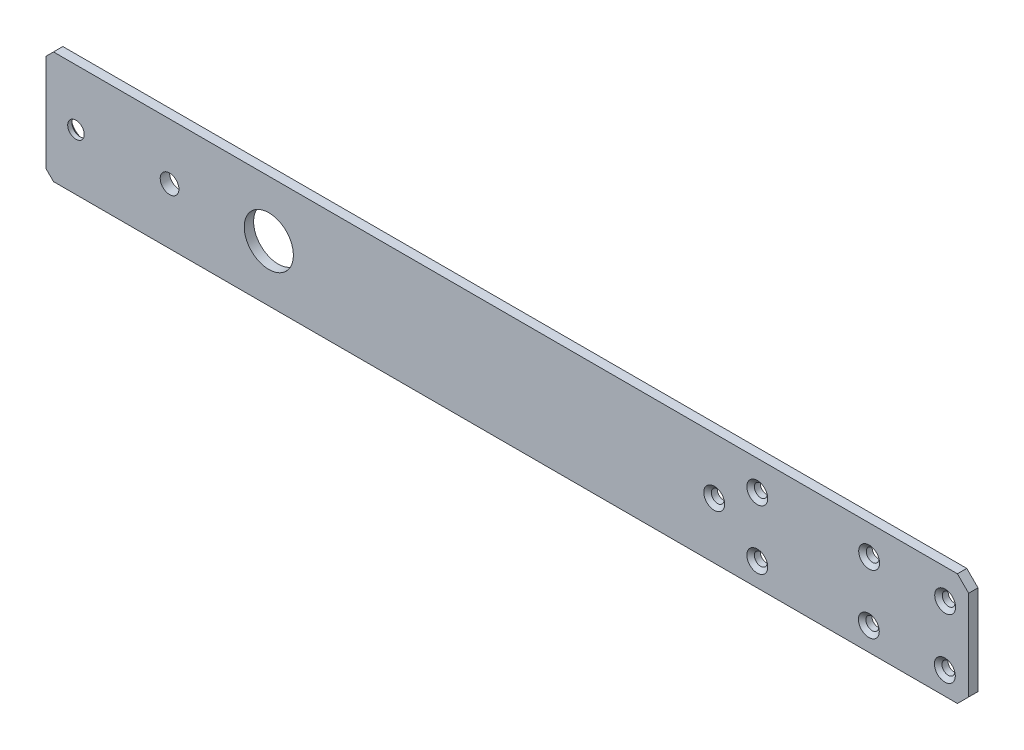
ISO-10303-21;
HEADER;
FILE_DESCRIPTION(('STEP AP214'),'2;1');
FILE_NAME('part.step','',(''),(''),'','','');
FILE_SCHEMA(('AUTOMOTIVE_DESIGN { 1 0 10303 214 1 1 1 1 }'));
ENDSEC;
DATA;
#1=APPLICATION_CONTEXT('core data for automotive mechanical design processes');
#2=APPLICATION_PROTOCOL_DEFINITION('international standard','automotive_design',2000,#1);
#3=PRODUCT_CONTEXT('',#1,'mechanical');
#4=PRODUCT('Part','Part','',(#3));
#5=PRODUCT_RELATED_PRODUCT_CATEGORY('part','',(#4));
#6=PRODUCT_DEFINITION_FORMATION('','',#4);
#7=PRODUCT_DEFINITION_CONTEXT('part definition',#1,'design');
#8=PRODUCT_DEFINITION('design','',#6,#7);
#9=PRODUCT_DEFINITION_SHAPE('','',#8);
#10=(LENGTH_UNIT() NAMED_UNIT(*) SI_UNIT(.MILLI.,.METRE.));
#11=(NAMED_UNIT(*) PLANE_ANGLE_UNIT() SI_UNIT($,.RADIAN.));
#12=(NAMED_UNIT(*) SI_UNIT($,.STERADIAN.) SOLID_ANGLE_UNIT());
#13=UNCERTAINTY_MEASURE_WITH_UNIT(LENGTH_MEASURE(1.E-05),#10,'distance_accuracy_value','');
#14=(GEOMETRIC_REPRESENTATION_CONTEXT(3) GLOBAL_UNCERTAINTY_ASSIGNED_CONTEXT((#13)) GLOBAL_UNIT_ASSIGNED_CONTEXT((#10,
#11,#12)) REPRESENTATION_CONTEXT('',''));
#15=CARTESIAN_POINT('',(0.,0.,0.));
#16=DIRECTION('',(0.,0.,1.));
#17=DIRECTION('',(1.,0.,0.));
#18=AXIS2_PLACEMENT_3D('',#15,#16,#17);
#19=CARTESIAN_POINT('',(0.,0.,1.5875));
#20=DIRECTION('',(0.,0.,-1.));
#21=DIRECTION('',(-1.,0.,0.));
#22=AXIS2_PLACEMENT_3D('',#19,#20,#21);
#23=PLANE('',#22);
#24=CARTESIAN_POINT('',(-33.6549999999997,0.,1.5875));
#25=DIRECTION('',(0.,0.,-1.));
#26=DIRECTION('',(-1.,0.,0.));
#27=AXIS2_PLACEMENT_3D('',#24,#25,#26);
#28=CIRCLE('',#27,3.175);
#29=CARTESIAN_POINT('',(-36.8299999999997,0.,1.5875));
#30=VERTEX_POINT('',#29);
#31=EDGE_CURVE('E495',#30,#30,#28,.T.);
#32=ORIENTED_EDGE('',*,*,#31,.T.);
#33=EDGE_LOOP('',(#32));
#34=FACE_BOUND('',#33,.T.);
#35=CARTESIAN_POINT('',(-65.4049999999997,0.,1.5875));
#36=DIRECTION('',(0.,0.,-1.));
#37=DIRECTION('',(-1.,0.,0.));
#38=AXIS2_PLACEMENT_3D('',#35,#36,#37);
#39=CIRCLE('',#38,2.8067);
#40=CARTESIAN_POINT('',(-68.2116999999997,0.,1.5875));
#41=VERTEX_POINT('',#40);
#42=EDGE_CURVE('E173',#41,#41,#39,.T.);
#43=ORIENTED_EDGE('',*,*,#42,.T.);
#44=EDGE_LOOP('',(#43));
#45=FACE_BOUND('',#44,.T.);
#46=CARTESIAN_POINT('',(203.608782335042,8.99137535087546,1.5875));
#47=DIRECTION('',(0.,0.,1.));
#48=DIRECTION('',(1.,0.,0.));
#49=AXIS2_PLACEMENT_3D('',#46,#47,#48);
#50=CIRCLE('',#49,3.5433);
#51=CARTESIAN_POINT('',(207.152082335042,8.99137535087546,1.5875));
#52=VERTEX_POINT('',#51);
#53=EDGE_CURVE('E175',#52,#52,#50,.T.);
#54=ORIENTED_EDGE('',*,*,#53,.F.);
#55=EDGE_LOOP('',(#54));
#56=FACE_BOUND('',#55,.T.);
#57=CARTESIAN_POINT('',(229.388701470581,8.92379178362501,1.5875));
#58=DIRECTION('',(0.,0.,1.));
#59=DIRECTION('',(1.,0.,0.));
#60=AXIS2_PLACEMENT_3D('',#57,#58,#59);
#61=CIRCLE('',#60,3.5433);
#62=CARTESIAN_POINT('',(232.932001470581,8.92379178362501,1.5875));
#63=VERTEX_POINT('',#62);
#64=EDGE_CURVE('E198',#63,#63,#61,.T.);
#65=ORIENTED_EDGE('',*,*,#64,.F.);
#66=EDGE_LOOP('',(#65));
#67=FACE_BOUND('',#66,.T.);
#68=CARTESIAN_POINT('',(165.672159691465,8.99137535087824,1.5875));
#69=DIRECTION('',(0.,0.,1.));
#70=DIRECTION('',(1.,0.,0.));
#71=AXIS2_PLACEMENT_3D('',#68,#69,#70);
#72=CIRCLE('',#71,3.5433);
#73=CARTESIAN_POINT('',(169.215459691465,8.99137535087824,1.5875));
#74=VERTEX_POINT('',#73);
#75=EDGE_CURVE('E204',#74,#74,#72,.T.);
#76=ORIENTED_EDGE('',*,*,#75,.F.);
#77=EDGE_LOOP('',(#76));
#78=FACE_BOUND('',#77,.T.);
#79=CARTESIAN_POINT('',(165.672159691465,-11.1439269688198,1.5875));
#80=DIRECTION('',(0.,0.,1.));
#81=DIRECTION('',(1.,0.,0.));
#82=AXIS2_PLACEMENT_3D('',#79,#80,#81);
#83=CIRCLE('',#82,3.5433);
#84=CARTESIAN_POINT('',(169.215459691465,-11.1439269688198,1.5875));
#85=VERTEX_POINT('',#84);
#86=EDGE_CURVE('E210',#85,#85,#83,.T.);
#87=ORIENTED_EDGE('',*,*,#86,.F.);
#88=EDGE_LOOP('',(#87));
#89=FACE_BOUND('',#88,.T.);
#90=CARTESIAN_POINT('',(151.067159691465,2.83106871279415E-12,1.5875));
#91=DIRECTION('',(0.,0.,1.));
#92=DIRECTION('',(1.,0.,0.));
#93=AXIS2_PLACEMENT_3D('',#90,#91,#92);
#94=CIRCLE('',#93,3.5433);
#95=CARTESIAN_POINT('',(154.610459691465,2.83106871279415E-12,1.5875));
#96=VERTEX_POINT('',#95);
#97=EDGE_CURVE('E216',#96,#96,#94,.T.);
#98=ORIENTED_EDGE('',*,*,#97,.F.);
#99=EDGE_LOOP('',(#98));
#100=FACE_BOUND('',#99,.T.);
#101=DIRECTION('',(-1.,0.,0.));
#102=VECTOR('',#101,1.);
#103=CARTESIAN_POINT('',(0.,19.05,1.5875));
#104=LINE('',#103,#102);
#105=CARTESIAN_POINT('',(233.542085197356,19.0500000000001,1.5875));
#106=VERTEX_POINT('',#105);
#107=CARTESIAN_POINT('',(-73.0249999999997,19.05,1.5875));
#108=VERTEX_POINT('',#107);
#109=EDGE_CURVE('E121',#106,#108,#104,.T.);
#110=ORIENTED_EDGE('',*,*,#109,.T.);
#111=DIRECTION('',(-0.70710678118654,-0.707106781186555,0.));
#112=VECTOR('',#111,1.);
#113=CARTESIAN_POINT('',(-73.0249999999997,19.05,1.5875));
#114=LINE('',#113,#112);
#115=CARTESIAN_POINT('',(-75.5649999999997,16.5099999999999,1.5875));
#116=VERTEX_POINT('',#115);
#117=EDGE_CURVE('E144',#108,#116,#114,.T.);
#118=ORIENTED_EDGE('',*,*,#117,.T.);
#119=DIRECTION('',(0.,-1.,0.));
#120=VECTOR('',#119,1.);
#121=CARTESIAN_POINT('',(-75.5649999999997,19.05,1.5875));
#122=LINE('',#121,#120);
#123=CARTESIAN_POINT('',(-75.5649999999997,-16.51,1.5875));
#124=VERTEX_POINT('',#123);
#125=EDGE_CURVE('E169',#116,#124,#122,.T.);
#126=ORIENTED_EDGE('',*,*,#125,.T.);
#127=DIRECTION('',(0.707106781186551,-0.707106781186544,0.));
#128=VECTOR('',#127,1.);
#129=CARTESIAN_POINT('',(-75.5649999999997,-16.51,1.5875));
#130=LINE('',#129,#128);
#131=CARTESIAN_POINT('',(-73.0249999999996,-19.05,1.5875));
#132=VERTEX_POINT('',#131);
#133=EDGE_CURVE('E142',#124,#132,#130,.T.);
#134=ORIENTED_EDGE('',*,*,#133,.T.);
#135=DIRECTION('',(1.,0.,0.));
#136=VECTOR('',#135,1.);
#137=CARTESIAN_POINT('',(-28.5749999999997,-19.05,1.5875));
#138=LINE('',#137,#136);
#139=CARTESIAN_POINT('',(233.542085197356,-19.05,1.5875));
#140=VERTEX_POINT('',#139);
#141=EDGE_CURVE('E124',#132,#140,#138,.T.);
#142=ORIENTED_EDGE('',*,*,#141,.T.);
#143=DIRECTION('',(-0.707106781186548,-0.707106781186547,0.));
#144=VECTOR('',#143,1.);
#145=CARTESIAN_POINT('',(233.542085197356,-19.05,1.5875));
#146=LINE('',#145,#144);
#147=CARTESIAN_POINT('',(237.352085197356,-15.24,1.5875));
#148=VERTEX_POINT('',#147);
#149=EDGE_CURVE('E120',#140,#148,#146,.F.);
#150=ORIENTED_EDGE('',*,*,#149,.T.);
#151=DIRECTION('',(0.,-1.,0.));
#152=VECTOR('',#151,1.);
#153=CARTESIAN_POINT('',(237.352085197356,19.0500000000001,1.5875));
#154=LINE('',#153,#152);
#155=CARTESIAN_POINT('',(237.352085197356,15.24,1.5875));
#156=VERTEX_POINT('',#155);
#157=EDGE_CURVE('E222',#156,#148,#154,.T.);
#158=ORIENTED_EDGE('',*,*,#157,.F.);
#159=DIRECTION('',(0.707106781186547,-0.707106781186548,0.));
#160=VECTOR('',#159,1.);
#161=CARTESIAN_POINT('',(237.352085197356,15.24,1.5875));
#162=LINE('',#161,#160);
#163=EDGE_CURVE('E130',#156,#106,#162,.F.);
#164=ORIENTED_EDGE('',*,*,#163,.T.);
#165=EDGE_LOOP('',(#110,#118,#126,#134,#142,#150,#158,#164));
#166=FACE_BOUND('',#165,.T.);
#167=CARTESIAN_POINT('',(0.,0.,1.5875));
#168=DIRECTION('',(0.,0.,1.));
#169=DIRECTION('',(1.,0.,0.));
#170=AXIS2_PLACEMENT_3D('',#167,#168,#169);
#171=CIRCLE('',#170,8.334375);
#172=CARTESIAN_POINT('',(8.334375,0.,1.5875));
#173=VERTEX_POINT('',#172);
#174=EDGE_CURVE('E105',#173,#173,#171,.T.);
#175=ORIENTED_EDGE('',*,*,#174,.F.);
#176=EDGE_LOOP('',(#175));
#177=FACE_BOUND('',#176,.T.);
#178=CARTESIAN_POINT('',(229.282371238552,-11.3467989682312,1.5875));
#179=DIRECTION('',(0.,0.,1.));
#180=DIRECTION('',(1.,0.,0.));
#181=AXIS2_PLACEMENT_3D('',#178,#179,#180);
#182=CIRCLE('',#181,3.5433);
#183=CARTESIAN_POINT('',(232.825671238552,-11.3467989682312,1.5875));
#184=VERTEX_POINT('',#183);
#185=EDGE_CURVE('E192',#184,#184,#182,.T.);
#186=ORIENTED_EDGE('',*,*,#185,.F.);
#187=EDGE_LOOP('',(#186));
#188=FACE_BOUND('',#187,.T.);
#189=CARTESIAN_POINT('',(203.503161764145,-11.1439269688226,1.5875));
#190=DIRECTION('',(0.,0.,1.));
#191=DIRECTION('',(1.,0.,0.));
#192=AXIS2_PLACEMENT_3D('',#189,#190,#191);
#193=CIRCLE('',#192,3.5433);
#194=CARTESIAN_POINT('',(207.046461764145,-11.1439269688226,1.5875));
#195=VERTEX_POINT('',#194);
#196=EDGE_CURVE('E186',#195,#195,#193,.T.);
#197=ORIENTED_EDGE('',*,*,#196,.F.);
#198=EDGE_LOOP('',(#197));
#199=FACE_BOUND('',#198,.T.);
#200=ADVANCED_FACE('F36',(#34,#45,#56,#67,#78,#89,#100,#166,#177,#188,#199),#23,.F.);
#201=CARTESIAN_POINT('',(0.,0.,-1.5875));
#202=DIRECTION('',(0.,0.,-1.));
#203=DIRECTION('',(-1.,0.,0.));
#204=AXIS2_PLACEMENT_3D('',#201,#202,#203);
#205=PLANE('',#204);
#206=CARTESIAN_POINT('',(-33.6549999999997,0.,-1.5875));
#207=DIRECTION('',(0.,0.,-1.));
#208=DIRECTION('',(-1.,0.,0.));
#209=AXIS2_PLACEMENT_3D('',#206,#207,#208);
#210=CIRCLE('',#209,3.175);
#211=CARTESIAN_POINT('',(-36.8299999999997,0.,-1.5875));
#212=VERTEX_POINT('',#211);
#213=EDGE_CURVE('E498',#212,#212,#210,.T.);
#214=ORIENTED_EDGE('',*,*,#213,.F.);
#215=EDGE_LOOP('',(#214));
#216=FACE_BOUND('',#215,.T.);
#217=CARTESIAN_POINT('',(-65.4049999999997,0.,-1.5875));
#218=DIRECTION('',(0.,0.,-1.));
#219=DIRECTION('',(-1.,0.,0.));
#220=AXIS2_PLACEMENT_3D('',#217,#218,#219);
#221=CIRCLE('',#220,4.8895);
#222=CARTESIAN_POINT('',(-70.2944999999996,0.,-1.5875));
#223=VERTEX_POINT('',#222);
#224=EDGE_CURVE('E500',#223,#223,#221,.T.);
#225=ORIENTED_EDGE('',*,*,#224,.F.);
#226=EDGE_LOOP('',(#225));
#227=FACE_BOUND('',#226,.T.);
#228=DIRECTION('',(0.,-1.,0.));
#229=VECTOR('',#228,1.);
#230=CARTESIAN_POINT('',(-75.5649999999997,19.05,-1.5875));
#231=LINE('',#230,#229);
#232=CARTESIAN_POINT('',(-75.5649999999997,16.5099999999999,-1.5875));
#233=VERTEX_POINT('',#232);
#234=CARTESIAN_POINT('',(-75.5649999999997,-16.51,-1.5875));
#235=VERTEX_POINT('',#234);
#236=EDGE_CURVE('E155',#233,#235,#231,.T.);
#237=ORIENTED_EDGE('',*,*,#236,.F.);
#238=DIRECTION('',(0.70710678118654,0.707106781186555,0.));
#239=VECTOR('',#238,1.);
#240=CARTESIAN_POINT('',(-46.0375000000006,46.0374999999996,-1.5875));
#241=LINE('',#240,#239);
#242=CARTESIAN_POINT('',(-73.0249999999996,19.05,-1.5875));
#243=VERTEX_POINT('',#242);
#244=EDGE_CURVE('E44',#233,#243,#241,.T.);
#245=ORIENTED_EDGE('',*,*,#244,.T.);
#246=DIRECTION('',(-1.,0.,0.));
#247=VECTOR('',#246,1.);
#248=CARTESIAN_POINT('',(0.,19.05,-1.5875));
#249=LINE('',#248,#247);
#250=CARTESIAN_POINT('',(233.542085197356,19.0500000000001,-1.5875));
#251=VERTEX_POINT('',#250);
#252=EDGE_CURVE('E104',#251,#243,#249,.T.);
#253=ORIENTED_EDGE('',*,*,#252,.F.);
#254=DIRECTION('',(-0.707106781186547,0.707106781186548,0.));
#255=VECTOR('',#254,1.);
#256=CARTESIAN_POINT('',(126.296042598678,126.296042598678,-1.5875));
#257=LINE('',#256,#255);
#258=CARTESIAN_POINT('',(237.352085197356,15.24,-1.5875));
#259=VERTEX_POINT('',#258);
#260=EDGE_CURVE('E116',#251,#259,#257,.F.);
#261=ORIENTED_EDGE('',*,*,#260,.T.);
#262=DIRECTION('',(0.,-1.,0.));
#263=VECTOR('',#262,1.);
#264=CARTESIAN_POINT('',(237.352085197356,19.0500000000001,-1.5875));
#265=LINE('',#264,#263);
#266=CARTESIAN_POINT('',(237.352085197356,-15.24,-1.5875));
#267=VERTEX_POINT('',#266);
#268=EDGE_CURVE('E113',#259,#267,#265,.T.);
#269=ORIENTED_EDGE('',*,*,#268,.T.);
#270=DIRECTION('',(0.707106781186548,0.707106781186547,0.));
#271=VECTOR('',#270,1.);
#272=CARTESIAN_POINT('',(126.296042598678,-126.296042598678,-1.5875));
#273=LINE('',#272,#271);
#274=CARTESIAN_POINT('',(233.542085197356,-19.05,-1.5875));
#275=VERTEX_POINT('',#274);
#276=EDGE_CURVE('E109',#267,#275,#273,.F.);
#277=ORIENTED_EDGE('',*,*,#276,.T.);
#278=DIRECTION('',(1.,0.,0.));
#279=VECTOR('',#278,1.);
#280=CARTESIAN_POINT('',(0.,-19.05,-1.5875));
#281=LINE('',#280,#279);
#282=CARTESIAN_POINT('',(-73.0249999999997,-19.05,-1.5875));
#283=VERTEX_POINT('',#282);
#284=EDGE_CURVE('E99',#283,#275,#281,.T.);
#285=ORIENTED_EDGE('',*,*,#284,.F.);
#286=DIRECTION('',(-0.707106781186551,0.707106781186544,0.));
#287=VECTOR('',#286,1.);
#288=CARTESIAN_POINT('',(-46.0374999999995,-46.0374999999999,-1.5875));
#289=LINE('',#288,#287);
#290=EDGE_CURVE('E56',#283,#235,#289,.T.);
#291=ORIENTED_EDGE('',*,*,#290,.T.);
#292=EDGE_LOOP('',(#237,#245,#253,#261,#269,#277,#285,#291));
#293=FACE_BOUND('',#292,.T.);
#294=CARTESIAN_POINT('',(229.388701470581,8.92379178362501,-1.5875));
#295=DIRECTION('',(0.,0.,1.));
#296=DIRECTION('',(1.,0.,0.));
#297=AXIS2_PLACEMENT_3D('',#294,#295,#296);
#298=CIRCLE('',#297,2.15265000000001);
#299=CARTESIAN_POINT('',(231.541351470581,8.92379178362501,-1.5875));
#300=VERTEX_POINT('',#299);
#301=EDGE_CURVE('E224',#300,#300,#298,.T.);
#302=ORIENTED_EDGE('',*,*,#301,.T.);
#303=EDGE_LOOP('',(#302));
#304=FACE_BOUND('',#303,.T.);
#305=CARTESIAN_POINT('',(229.282371238552,-11.3467989682312,-1.5875));
#306=DIRECTION('',(0.,0.,1.));
#307=DIRECTION('',(1.,0.,0.));
#308=AXIS2_PLACEMENT_3D('',#305,#306,#307);
#309=CIRCLE('',#308,2.15265000000001);
#310=CARTESIAN_POINT('',(231.435021238552,-11.3467989682312,-1.5875));
#311=VERTEX_POINT('',#310);
#312=EDGE_CURVE('E229',#311,#311,#309,.T.);
#313=ORIENTED_EDGE('',*,*,#312,.T.);
#314=EDGE_LOOP('',(#313));
#315=FACE_BOUND('',#314,.T.);
#316=CARTESIAN_POINT('',(203.503161764145,-11.1439269688226,-1.5875));
#317=DIRECTION('',(0.,0.,1.));
#318=DIRECTION('',(1.,0.,0.));
#319=AXIS2_PLACEMENT_3D('',#316,#317,#318);
#320=CIRCLE('',#319,2.15265000000001);
#321=CARTESIAN_POINT('',(205.655811764145,-11.1439269688226,-1.5875));
#322=VERTEX_POINT('',#321);
#323=EDGE_CURVE('E232',#322,#322,#320,.T.);
#324=ORIENTED_EDGE('',*,*,#323,.T.);
#325=EDGE_LOOP('',(#324));
#326=FACE_BOUND('',#325,.T.);
#327=CARTESIAN_POINT('',(203.608782335042,8.99137535087546,-1.5875));
#328=DIRECTION('',(0.,0.,1.));
#329=DIRECTION('',(1.,0.,0.));
#330=AXIS2_PLACEMENT_3D('',#327,#328,#329);
#331=CIRCLE('',#330,2.15265000000001);
#332=CARTESIAN_POINT('',(205.761432335042,8.99137535087546,-1.5875));
#333=VERTEX_POINT('',#332);
#334=EDGE_CURVE('E235',#333,#333,#331,.T.);
#335=ORIENTED_EDGE('',*,*,#334,.T.);
#336=EDGE_LOOP('',(#335));
#337=FACE_BOUND('',#336,.T.);
#338=CARTESIAN_POINT('',(165.672159691465,8.99137535087824,-1.5875));
#339=DIRECTION('',(0.,0.,1.));
#340=DIRECTION('',(1.,0.,0.));
#341=AXIS2_PLACEMENT_3D('',#338,#339,#340);
#342=CIRCLE('',#341,2.15265000000001);
#343=CARTESIAN_POINT('',(167.824809691465,8.99137535087824,-1.5875));
#344=VERTEX_POINT('',#343);
#345=EDGE_CURVE('E238',#344,#344,#342,.T.);
#346=ORIENTED_EDGE('',*,*,#345,.T.);
#347=EDGE_LOOP('',(#346));
#348=FACE_BOUND('',#347,.T.);
#349=CARTESIAN_POINT('',(165.672159691465,-11.1439269688198,-1.5875));
#350=DIRECTION('',(0.,0.,1.));
#351=DIRECTION('',(1.,0.,0.));
#352=AXIS2_PLACEMENT_3D('',#349,#350,#351);
#353=CIRCLE('',#352,2.15265000000001);
#354=CARTESIAN_POINT('',(167.824809691465,-11.1439269688198,-1.5875));
#355=VERTEX_POINT('',#354);
#356=EDGE_CURVE('E241',#355,#355,#353,.T.);
#357=ORIENTED_EDGE('',*,*,#356,.T.);
#358=EDGE_LOOP('',(#357));
#359=FACE_BOUND('',#358,.T.);
#360=CARTESIAN_POINT('',(151.067159691465,2.83106871279415E-12,-1.5875));
#361=DIRECTION('',(0.,0.,1.));
#362=DIRECTION('',(1.,0.,0.));
#363=AXIS2_PLACEMENT_3D('',#360,#361,#362);
#364=CIRCLE('',#363,2.15265000000001);
#365=CARTESIAN_POINT('',(153.219809691465,2.83106871279415E-12,-1.5875));
#366=VERTEX_POINT('',#365);
#367=EDGE_CURVE('E244',#366,#366,#364,.T.);
#368=ORIENTED_EDGE('',*,*,#367,.T.);
#369=EDGE_LOOP('',(#368));
#370=FACE_BOUND('',#369,.T.);
#371=CARTESIAN_POINT('',(0.,0.,-1.5875));
#372=DIRECTION('',(0.,0.,1.));
#373=DIRECTION('',(1.,0.,0.));
#374=AXIS2_PLACEMENT_3D('',#371,#372,#373);
#375=CIRCLE('',#374,8.334375);
#376=CARTESIAN_POINT('',(8.334375,0.,-1.5875));
#377=VERTEX_POINT('',#376);
#378=EDGE_CURVE('E247',#377,#377,#375,.T.);
#379=ORIENTED_EDGE('',*,*,#378,.T.);
#380=EDGE_LOOP('',(#379));
#381=FACE_BOUND('',#380,.T.);
#382=ADVANCED_FACE('F110',(#216,#227,#293,#304,#315,#326,#337,#348,#359,#370,#381),#205,.T.);
#383=CARTESIAN_POINT('',(0.,-19.05,1.5875));
#384=DIRECTION('',(0.,1.,0.));
#385=DIRECTION('',(0.,0.,1.));
#386=AXIS2_PLACEMENT_3D('',#383,#384,#385);
#387=PLANE('',#386);
#388=ORIENTED_EDGE('',*,*,#141,.F.);
#389=DIRECTION('',(0.,0.,-1.));
#390=VECTOR('',#389,1.);
#391=CARTESIAN_POINT('',(-73.0249999999997,-19.05,-1.5875));
#392=LINE('',#391,#390);
#393=EDGE_CURVE('E11',#132,#283,#392,.T.);
#394=ORIENTED_EDGE('',*,*,#393,.T.);
#395=ORIENTED_EDGE('',*,*,#284,.T.);
#396=DIRECTION('',(0.,0.,1.));
#397=VECTOR('',#396,1.);
#398=CARTESIAN_POINT('',(233.542085197356,-19.05,1.5875));
#399=LINE('',#398,#397);
#400=EDGE_CURVE('E103',#275,#140,#399,.T.);
#401=ORIENTED_EDGE('',*,*,#400,.T.);
#402=EDGE_LOOP('',(#388,#394,#395,#401));
#403=FACE_BOUND('',#402,.T.);
#404=ADVANCED_FACE('F101',(#403),#387,.F.);
#405=CARTESIAN_POINT('',(0.,19.05,1.5875));
#406=DIRECTION('',(0.,-1.,0.));
#407=DIRECTION('',(1.,0.,0.));
#408=AXIS2_PLACEMENT_3D('',#405,#406,#407);
#409=PLANE('',#408);
#410=ORIENTED_EDGE('',*,*,#252,.T.);
#411=DIRECTION('',(0.,0.,1.));
#412=VECTOR('',#411,1.);
#413=CARTESIAN_POINT('',(-73.0249999999997,19.05,1.5875));
#414=LINE('',#413,#412);
#415=EDGE_CURVE('E139',#243,#108,#414,.T.);
#416=ORIENTED_EDGE('',*,*,#415,.T.);
#417=ORIENTED_EDGE('',*,*,#109,.F.);
#418=DIRECTION('',(0.,0.,-1.));
#419=VECTOR('',#418,1.);
#420=CARTESIAN_POINT('',(233.542085197356,19.0500000000001,1.5875));
#421=LINE('',#420,#419);
#422=EDGE_CURVE('E132',#106,#251,#421,.T.);
#423=ORIENTED_EDGE('',*,*,#422,.T.);
#424=EDGE_LOOP('',(#410,#416,#417,#423));
#425=FACE_BOUND('',#424,.T.);
#426=ADVANCED_FACE('F160',(#425),#409,.F.);
#427=CARTESIAN_POINT('',(0.,0.,1.5875));
#428=DIRECTION('',(0.,0.,-1.));
#429=DIRECTION('',(-1.,0.,0.));
#430=AXIS2_PLACEMENT_3D('',#427,#428,#429);
#431=CYLINDRICAL_SURFACE('',#430,8.334375);
#432=ORIENTED_EDGE('',*,*,#174,.T.);
#433=EDGE_LOOP('',(#432));
#434=FACE_BOUND('',#433,.T.);
#435=ORIENTED_EDGE('',*,*,#378,.F.);
#436=EDGE_LOOP('',(#435));
#437=FACE_BOUND('',#436,.T.);
#438=ADVANCED_FACE('F274',(#434,#437),#431,.F.);
#439=CARTESIAN_POINT('',(151.067159691465,2.83106871279415E-12,1.5875));
#440=DIRECTION('',(0.,0.,1.));
#441=DIRECTION('',(1.,0.,0.));
#442=AXIS2_PLACEMENT_3D('',#439,#440,#441);
#443=CYLINDRICAL_SURFACE('',#442,2.15265000000001);
#444=CARTESIAN_POINT('',(151.067159691465,2.83106871279415E-12,0.420606097903323));
#445=DIRECTION('',(0.,0.,1.));
#446=DIRECTION('',(1.,0.,0.));
#447=AXIS2_PLACEMENT_3D('',#444,#445,#446);
#448=CIRCLE('',#447,2.15264999999998);
#449=CARTESIAN_POINT('',(153.219809691465,2.83106871279415E-12,0.420606097903323));
#450=VERTEX_POINT('',#449);
#451=EDGE_CURVE('E219',#450,#450,#448,.T.);
#452=ORIENTED_EDGE('',*,*,#451,.T.);
#453=EDGE_LOOP('',(#452));
#454=FACE_BOUND('',#453,.T.);
#455=ORIENTED_EDGE('',*,*,#367,.F.);
#456=EDGE_LOOP('',(#455));
#457=FACE_BOUND('',#456,.T.);
#458=ADVANCED_FACE('F329',(#454,#457),#443,.F.);
#459=CARTESIAN_POINT('',(165.672159691465,-11.1439269688198,1.5875));
#460=DIRECTION('',(0.,0.,1.));
#461=DIRECTION('',(1.,0.,0.));
#462=AXIS2_PLACEMENT_3D('',#459,#460,#461);
#463=CYLINDRICAL_SURFACE('',#462,2.15265000000001);
#464=CARTESIAN_POINT('',(165.672159691465,-11.1439269688198,0.420606097903323));
#465=DIRECTION('',(0.,0.,1.));
#466=DIRECTION('',(1.,0.,0.));
#467=AXIS2_PLACEMENT_3D('',#464,#465,#466);
#468=CIRCLE('',#467,2.15264999999998);
#469=CARTESIAN_POINT('',(167.824809691465,-11.1439269688198,0.420606097903323));
#470=VERTEX_POINT('',#469);
#471=EDGE_CURVE('E213',#470,#470,#468,.T.);
#472=ORIENTED_EDGE('',*,*,#471,.T.);
#473=EDGE_LOOP('',(#472));
#474=FACE_BOUND('',#473,.T.);
#475=ORIENTED_EDGE('',*,*,#356,.F.);
#476=EDGE_LOOP('',(#475));
#477=FACE_BOUND('',#476,.T.);
#478=ADVANCED_FACE('F326',(#474,#477),#463,.F.);
#479=CARTESIAN_POINT('',(165.672159691465,8.99137535087824,1.5875));
#480=DIRECTION('',(0.,0.,1.));
#481=DIRECTION('',(1.,0.,0.));
#482=AXIS2_PLACEMENT_3D('',#479,#480,#481);
#483=CYLINDRICAL_SURFACE('',#482,2.15265000000001);
#484=CARTESIAN_POINT('',(165.672159691465,8.99137535087824,0.420606097903323));
#485=DIRECTION('',(0.,0.,1.));
#486=DIRECTION('',(1.,0.,0.));
#487=AXIS2_PLACEMENT_3D('',#484,#485,#486);
#488=CIRCLE('',#487,2.15264999999998);
#489=CARTESIAN_POINT('',(167.824809691465,8.99137535087824,0.420606097903323));
#490=VERTEX_POINT('',#489);
#491=EDGE_CURVE('E207',#490,#490,#488,.T.);
#492=ORIENTED_EDGE('',*,*,#491,.T.);
#493=EDGE_LOOP('',(#492));
#494=FACE_BOUND('',#493,.T.);
#495=ORIENTED_EDGE('',*,*,#345,.F.);
#496=EDGE_LOOP('',(#495));
#497=FACE_BOUND('',#496,.T.);
#498=ADVANCED_FACE('F322',(#494,#497),#483,.F.);
#499=CARTESIAN_POINT('',(203.608782335042,8.99137535087546,1.5875));
#500=DIRECTION('',(0.,0.,1.));
#501=DIRECTION('',(1.,0.,0.));
#502=AXIS2_PLACEMENT_3D('',#499,#500,#501);
#503=CYLINDRICAL_SURFACE('',#502,2.15265000000001);
#504=CARTESIAN_POINT('',(203.608782335042,8.99137535087546,0.420606097903323));
#505=DIRECTION('',(0.,0.,1.));
#506=DIRECTION('',(1.,0.,0.));
#507=AXIS2_PLACEMENT_3D('',#504,#505,#506);
#508=CIRCLE('',#507,2.15264999999998);
#509=CARTESIAN_POINT('',(205.761432335042,8.99137535087546,0.420606097903323));
#510=VERTEX_POINT('',#509);
#511=EDGE_CURVE('E183',#510,#510,#508,.T.);
#512=ORIENTED_EDGE('',*,*,#511,.T.);
#513=EDGE_LOOP('',(#512));
#514=FACE_BOUND('',#513,.T.);
#515=ORIENTED_EDGE('',*,*,#334,.F.);
#516=EDGE_LOOP('',(#515));
#517=FACE_BOUND('',#516,.T.);
#518=ADVANCED_FACE('F318',(#514,#517),#503,.F.);
#519=CARTESIAN_POINT('',(203.503161764145,-11.1439269688226,1.5875));
#520=DIRECTION('',(0.,0.,1.));
#521=DIRECTION('',(1.,0.,0.));
#522=AXIS2_PLACEMENT_3D('',#519,#520,#521);
#523=CYLINDRICAL_SURFACE('',#522,2.15265000000001);
#524=CARTESIAN_POINT('',(203.503161764145,-11.1439269688226,0.420606097903323));
#525=DIRECTION('',(0.,0.,1.));
#526=DIRECTION('',(1.,0.,0.));
#527=AXIS2_PLACEMENT_3D('',#524,#525,#526);
#528=CIRCLE('',#527,2.15264999999998);
#529=CARTESIAN_POINT('',(205.655811764145,-11.1439269688226,0.420606097903323));
#530=VERTEX_POINT('',#529);
#531=EDGE_CURVE('E189',#530,#530,#528,.T.);
#532=ORIENTED_EDGE('',*,*,#531,.T.);
#533=EDGE_LOOP('',(#532));
#534=FACE_BOUND('',#533,.T.);
#535=ORIENTED_EDGE('',*,*,#323,.F.);
#536=EDGE_LOOP('',(#535));
#537=FACE_BOUND('',#536,.T.);
#538=ADVANCED_FACE('F314',(#534,#537),#523,.F.);
#539=CARTESIAN_POINT('',(229.282371238552,-11.3467989682312,1.5875));
#540=DIRECTION('',(0.,0.,1.));
#541=DIRECTION('',(1.,0.,0.));
#542=AXIS2_PLACEMENT_3D('',#539,#540,#541);
#543=CYLINDRICAL_SURFACE('',#542,2.15265000000001);
#544=CARTESIAN_POINT('',(229.282371238552,-11.3467989682312,0.420606097903323));
#545=DIRECTION('',(0.,0.,1.));
#546=DIRECTION('',(1.,0.,0.));
#547=AXIS2_PLACEMENT_3D('',#544,#545,#546);
#548=CIRCLE('',#547,2.15264999999998);
#549=CARTESIAN_POINT('',(231.435021238552,-11.3467989682312,0.420606097903323));
#550=VERTEX_POINT('',#549);
#551=EDGE_CURVE('E195',#550,#550,#548,.T.);
#552=ORIENTED_EDGE('',*,*,#551,.T.);
#553=EDGE_LOOP('',(#552));
#554=FACE_BOUND('',#553,.T.);
#555=ORIENTED_EDGE('',*,*,#312,.F.);
#556=EDGE_LOOP('',(#555));
#557=FACE_BOUND('',#556,.T.);
#558=ADVANCED_FACE('F310',(#554,#557),#543,.F.);
#559=CARTESIAN_POINT('',(229.388701470581,8.92379178362501,1.5875));
#560=DIRECTION('',(0.,0.,1.));
#561=DIRECTION('',(1.,0.,0.));
#562=AXIS2_PLACEMENT_3D('',#559,#560,#561);
#563=CYLINDRICAL_SURFACE('',#562,2.15265000000001);
#564=CARTESIAN_POINT('',(229.388701470581,8.92379178362501,0.420606097903323));
#565=DIRECTION('',(0.,0.,1.));
#566=DIRECTION('',(1.,0.,0.));
#567=AXIS2_PLACEMENT_3D('',#564,#565,#566);
#568=CIRCLE('',#567,2.15264999999998);
#569=CARTESIAN_POINT('',(231.541351470581,8.92379178362501,0.420606097903323));
#570=VERTEX_POINT('',#569);
#571=EDGE_CURVE('E201',#570,#570,#568,.T.);
#572=ORIENTED_EDGE('',*,*,#571,.T.);
#573=EDGE_LOOP('',(#572));
#574=FACE_BOUND('',#573,.T.);
#575=ORIENTED_EDGE('',*,*,#301,.F.);
#576=EDGE_LOOP('',(#575));
#577=FACE_BOUND('',#576,.T.);
#578=ADVANCED_FACE('F306',(#574,#577),#563,.F.);
#579=CARTESIAN_POINT('',(237.352085197356,19.0500000000001,-1.5875));
#580=DIRECTION('',(-1.,0.,0.));
#581=DIRECTION('',(0.,-1.,0.));
#582=AXIS2_PLACEMENT_3D('',#579,#580,#581);
#583=PLANE('',#582);
#584=ORIENTED_EDGE('',*,*,#268,.F.);
#585=DIRECTION('',(0.,0.,1.));
#586=VECTOR('',#585,1.);
#587=CARTESIAN_POINT('',(237.352085197356,15.24,-1.5875));
#588=LINE('',#587,#586);
#589=EDGE_CURVE('E136',#259,#156,#588,.T.);
#590=ORIENTED_EDGE('',*,*,#589,.T.);
#591=ORIENTED_EDGE('',*,*,#157,.T.);
#592=DIRECTION('',(0.,0.,-1.));
#593=VECTOR('',#592,1.);
#594=CARTESIAN_POINT('',(237.352085197356,-15.24,-1.5875));
#595=LINE('',#594,#593);
#596=EDGE_CURVE('E134',#148,#267,#595,.T.);
#597=ORIENTED_EDGE('',*,*,#596,.T.);
#598=EDGE_LOOP('',(#584,#590,#591,#597));
#599=FACE_BOUND('',#598,.T.);
#600=ADVANCED_FACE('F284',(#599),#583,.F.);
#601=CARTESIAN_POINT('',(237.352085197356,15.24,-1.5875));
#602=DIRECTION('',(-0.707106781186548,-0.707106781186547,0.));
#603=DIRECTION('',(0.,0.,1.));
#604=AXIS2_PLACEMENT_3D('',#601,#602,#603);
#605=PLANE('',#604);
#606=ORIENTED_EDGE('',*,*,#260,.F.);
#607=ORIENTED_EDGE('',*,*,#422,.F.);
#608=ORIENTED_EDGE('',*,*,#163,.F.);
#609=ORIENTED_EDGE('',*,*,#589,.F.);
#610=EDGE_LOOP('',(#606,#607,#608,#609));
#611=FACE_BOUND('',#610,.T.);
#612=ADVANCED_FACE('F281',(#611),#605,.F.);
#613=CARTESIAN_POINT('',(233.542085197356,-19.05,1.5875));
#614=DIRECTION('',(-0.707106781186547,0.707106781186548,0.));
#615=DIRECTION('',(0.,0.,1.));
#616=AXIS2_PLACEMENT_3D('',#613,#614,#615);
#617=PLANE('',#616);
#618=ORIENTED_EDGE('',*,*,#276,.F.);
#619=ORIENTED_EDGE('',*,*,#596,.F.);
#620=ORIENTED_EDGE('',*,*,#149,.F.);
#621=ORIENTED_EDGE('',*,*,#400,.F.);
#622=EDGE_LOOP('',(#618,#619,#620,#621));
#623=FACE_BOUND('',#622,.T.);
#624=ADVANCED_FACE('F119',(#623),#617,.F.);
#625=CARTESIAN_POINT('',(151.067159691465,2.83106871279415E-12,1.5875));
#626=DIRECTION('',(0.,0.,1.));
#627=DIRECTION('',(1.,0.,0.));
#628=AXIS2_PLACEMENT_3D('',#625,#626,#627);
#629=CONICAL_SURFACE('',#628,3.5433,0.872664625997175);
#630=ORIENTED_EDGE('',*,*,#451,.F.);
#631=EDGE_LOOP('',(#630));
#632=FACE_BOUND('',#631,.T.);
#633=ORIENTED_EDGE('',*,*,#97,.T.);
#634=EDGE_LOOP('',(#633));
#635=FACE_BOUND('',#634,.T.);
#636=ADVANCED_FACE('F287',(#632,#635),#629,.F.);
#637=CARTESIAN_POINT('',(165.672159691465,-11.1439269688198,1.5875));
#638=DIRECTION('',(0.,0.,1.));
#639=DIRECTION('',(1.,0.,0.));
#640=AXIS2_PLACEMENT_3D('',#637,#638,#639);
#641=CONICAL_SURFACE('',#640,3.5433,0.872664625997175);
#642=ORIENTED_EDGE('',*,*,#471,.F.);
#643=EDGE_LOOP('',(#642));
#644=FACE_BOUND('',#643,.T.);
#645=ORIENTED_EDGE('',*,*,#86,.T.);
#646=EDGE_LOOP('',(#645));
#647=FACE_BOUND('',#646,.T.);
#648=ADVANCED_FACE('F291',(#644,#647),#641,.F.);
#649=CARTESIAN_POINT('',(165.672159691465,8.99137535087824,1.5875));
#650=DIRECTION('',(0.,0.,1.));
#651=DIRECTION('',(1.,0.,0.));
#652=AXIS2_PLACEMENT_3D('',#649,#650,#651);
#653=CONICAL_SURFACE('',#652,3.5433,0.872664625997175);
#654=ORIENTED_EDGE('',*,*,#491,.F.);
#655=EDGE_LOOP('',(#654));
#656=FACE_BOUND('',#655,.T.);
#657=ORIENTED_EDGE('',*,*,#75,.T.);
#658=EDGE_LOOP('',(#657));
#659=FACE_BOUND('',#658,.T.);
#660=ADVANCED_FACE('F297',(#656,#659),#653,.F.);
#661=CARTESIAN_POINT('',(229.388701470581,8.92379178362501,1.5875));
#662=DIRECTION('',(0.,0.,1.));
#663=DIRECTION('',(1.,0.,0.));
#664=AXIS2_PLACEMENT_3D('',#661,#662,#663);
#665=CONICAL_SURFACE('',#664,3.5433,0.872664625997175);
#666=ORIENTED_EDGE('',*,*,#571,.F.);
#667=EDGE_LOOP('',(#666));
#668=FACE_BOUND('',#667,.T.);
#669=ORIENTED_EDGE('',*,*,#64,.T.);
#670=EDGE_LOOP('',(#669));
#671=FACE_BOUND('',#670,.T.);
#672=ADVANCED_FACE('F363',(#668,#671),#665,.F.);
#673=CARTESIAN_POINT('',(229.282371238552,-11.3467989682312,1.5875));
#674=DIRECTION('',(0.,0.,1.));
#675=DIRECTION('',(1.,0.,0.));
#676=AXIS2_PLACEMENT_3D('',#673,#674,#675);
#677=CONICAL_SURFACE('',#676,3.5433,0.872664625997175);
#678=ORIENTED_EDGE('',*,*,#551,.F.);
#679=EDGE_LOOP('',(#678));
#680=FACE_BOUND('',#679,.T.);
#681=ORIENTED_EDGE('',*,*,#185,.T.);
#682=EDGE_LOOP('',(#681));
#683=FACE_BOUND('',#682,.T.);
#684=ADVANCED_FACE('F354',(#680,#683),#677,.F.);
#685=CARTESIAN_POINT('',(203.503161764145,-11.1439269688226,1.5875));
#686=DIRECTION('',(0.,0.,1.));
#687=DIRECTION('',(1.,0.,0.));
#688=AXIS2_PLACEMENT_3D('',#685,#686,#687);
#689=CONICAL_SURFACE('',#688,3.5433,0.872664625997175);
#690=ORIENTED_EDGE('',*,*,#531,.F.);
#691=EDGE_LOOP('',(#690));
#692=FACE_BOUND('',#691,.T.);
#693=ORIENTED_EDGE('',*,*,#196,.T.);
#694=EDGE_LOOP('',(#693));
#695=FACE_BOUND('',#694,.T.);
#696=ADVANCED_FACE('F351',(#692,#695),#689,.F.);
#697=CARTESIAN_POINT('',(203.608782335042,8.99137535087546,1.5875));
#698=DIRECTION('',(0.,0.,1.));
#699=DIRECTION('',(1.,0.,0.));
#700=AXIS2_PLACEMENT_3D('',#697,#698,#699);
#701=CONICAL_SURFACE('',#700,3.5433,0.872664625997175);
#702=ORIENTED_EDGE('',*,*,#511,.F.);
#703=EDGE_LOOP('',(#702));
#704=FACE_BOUND('',#703,.T.);
#705=ORIENTED_EDGE('',*,*,#53,.T.);
#706=EDGE_LOOP('',(#705));
#707=FACE_BOUND('',#706,.T.);
#708=ADVANCED_FACE('F353',(#704,#707),#701,.F.);
#709=CARTESIAN_POINT('',(-75.5649999999997,19.05,-1.5875));
#710=DIRECTION('',(-1.,0.,0.));
#711=DIRECTION('',(0.,0.,1.));
#712=AXIS2_PLACEMENT_3D('',#709,#710,#711);
#713=PLANE('',#712);
#714=ORIENTED_EDGE('',*,*,#125,.F.);
#715=DIRECTION('',(0.,0.,-1.));
#716=VECTOR('',#715,1.);
#717=CARTESIAN_POINT('',(-75.5649999999997,16.5099999999999,-1.5875));
#718=LINE('',#717,#716);
#719=EDGE_CURVE('E149',#116,#233,#718,.T.);
#720=ORIENTED_EDGE('',*,*,#719,.T.);
#721=ORIENTED_EDGE('',*,*,#236,.T.);
#722=DIRECTION('',(0.,0.,1.));
#723=VECTOR('',#722,1.);
#724=CARTESIAN_POINT('',(-75.5649999999997,-16.51,1.5875));
#725=LINE('',#724,#723);
#726=EDGE_CURVE('E146',#235,#124,#725,.T.);
#727=ORIENTED_EDGE('',*,*,#726,.T.);
#728=EDGE_LOOP('',(#714,#720,#721,#727));
#729=FACE_BOUND('',#728,.T.);
#730=ADVANCED_FACE('F171',(#729),#713,.T.);
#731=CARTESIAN_POINT('',(-73.0249999999997,19.05,1.5875));
#732=DIRECTION('',(-0.707106781186555,0.70710678118654,0.));
#733=DIRECTION('',(0.,0.,-1.));
#734=AXIS2_PLACEMENT_3D('',#731,#732,#733);
#735=PLANE('',#734);
#736=ORIENTED_EDGE('',*,*,#244,.F.);
#737=ORIENTED_EDGE('',*,*,#719,.F.);
#738=ORIENTED_EDGE('',*,*,#117,.F.);
#739=ORIENTED_EDGE('',*,*,#415,.F.);
#740=EDGE_LOOP('',(#736,#737,#738,#739));
#741=FACE_BOUND('',#740,.T.);
#742=ADVANCED_FACE('F164',(#741),#735,.T.);
#743=CARTESIAN_POINT('',(-75.5649999999997,-16.51,-1.5875));
#744=DIRECTION('',(-0.707106781186544,-0.707106781186551,0.));
#745=DIRECTION('',(0.,0.,-1.));
#746=AXIS2_PLACEMENT_3D('',#743,#744,#745);
#747=PLANE('',#746);
#748=ORIENTED_EDGE('',*,*,#290,.F.);
#749=ORIENTED_EDGE('',*,*,#393,.F.);
#750=ORIENTED_EDGE('',*,*,#133,.F.);
#751=ORIENTED_EDGE('',*,*,#726,.F.);
#752=EDGE_LOOP('',(#748,#749,#750,#751));
#753=FACE_BOUND('',#752,.T.);
#754=ADVANCED_FACE('F38',(#753),#747,.T.);
#755=CARTESIAN_POINT('',(-65.4049999999997,0.,-1.5875));
#756=DIRECTION('',(0.,0.,-1.));
#757=DIRECTION('',(-1.,0.,0.));
#758=AXIS2_PLACEMENT_3D('',#755,#756,#757);
#759=CYLINDRICAL_SURFACE('',#758,2.8067);
#760=ORIENTED_EDGE('',*,*,#42,.F.);
#761=EDGE_LOOP('',(#760));
#762=FACE_BOUND('',#761,.T.);
#763=CARTESIAN_POINT('',(-65.4049999999997,0.,0.160176711816041));
#764=DIRECTION('',(0.,0.,-1.));
#765=DIRECTION('',(-1.,0.,0.));
#766=AXIS2_PLACEMENT_3D('',#763,#764,#765);
#767=CIRCLE('',#766,2.8067);
#768=CARTESIAN_POINT('',(-68.2116999999997,0.,0.160176711816041));
#769=VERTEX_POINT('',#768);
#770=EDGE_CURVE('E178',#769,#769,#767,.T.);
#771=ORIENTED_EDGE('',*,*,#770,.T.);
#772=EDGE_LOOP('',(#771));
#773=FACE_BOUND('',#772,.T.);
#774=ADVANCED_FACE('F255',(#762,#773),#759,.F.);
#775=CARTESIAN_POINT('',(-65.4049999999997,0.,-1.5875));
#776=DIRECTION('',(0.,0.,-1.));
#777=DIRECTION('',(-1.,0.,0.));
#778=AXIS2_PLACEMENT_3D('',#775,#776,#777);
#779=CONICAL_SURFACE('',#778,4.8895,0.872664625997165);
#780=ORIENTED_EDGE('',*,*,#770,.F.);
#781=EDGE_LOOP('',(#780));
#782=FACE_BOUND('',#781,.T.);
#783=ORIENTED_EDGE('',*,*,#224,.T.);
#784=EDGE_LOOP('',(#783));
#785=FACE_BOUND('',#784,.T.);
#786=ADVANCED_FACE('F260',(#782,#785),#779,.F.);
#787=CARTESIAN_POINT('',(-33.6549999999997,0.,-1.5875));
#788=DIRECTION('',(0.,0.,-1.));
#789=DIRECTION('',(-1.,0.,0.));
#790=AXIS2_PLACEMENT_3D('',#787,#788,#789);
#791=CYLINDRICAL_SURFACE('',#790,3.175);
#792=ORIENTED_EDGE('',*,*,#31,.F.);
#793=EDGE_LOOP('',(#792));
#794=FACE_BOUND('',#793,.T.);
#795=ORIENTED_EDGE('',*,*,#213,.T.);
#796=EDGE_LOOP('',(#795));
#797=FACE_BOUND('',#796,.T.);
#798=ADVANCED_FACE('F457',(#794,#797),#791,.F.);
#799=CLOSED_SHELL('',(#200,#382,#404,#426,#438,#458,#478,#498,#518,#538,#558,#578,#600,#612,
#624,#636,#648,#660,#672,#684,#696,#708,#730,#742,#754,#774,#786,#798));
#800=MANIFOLD_SOLID_BREP('B2',#799);
#801=ADVANCED_BREP_SHAPE_REPRESENTATION('',(#18,#800),#14);
#802=SHAPE_DEFINITION_REPRESENTATION(#9,#801);
ENDSEC;
END-ISO-10303-21;
